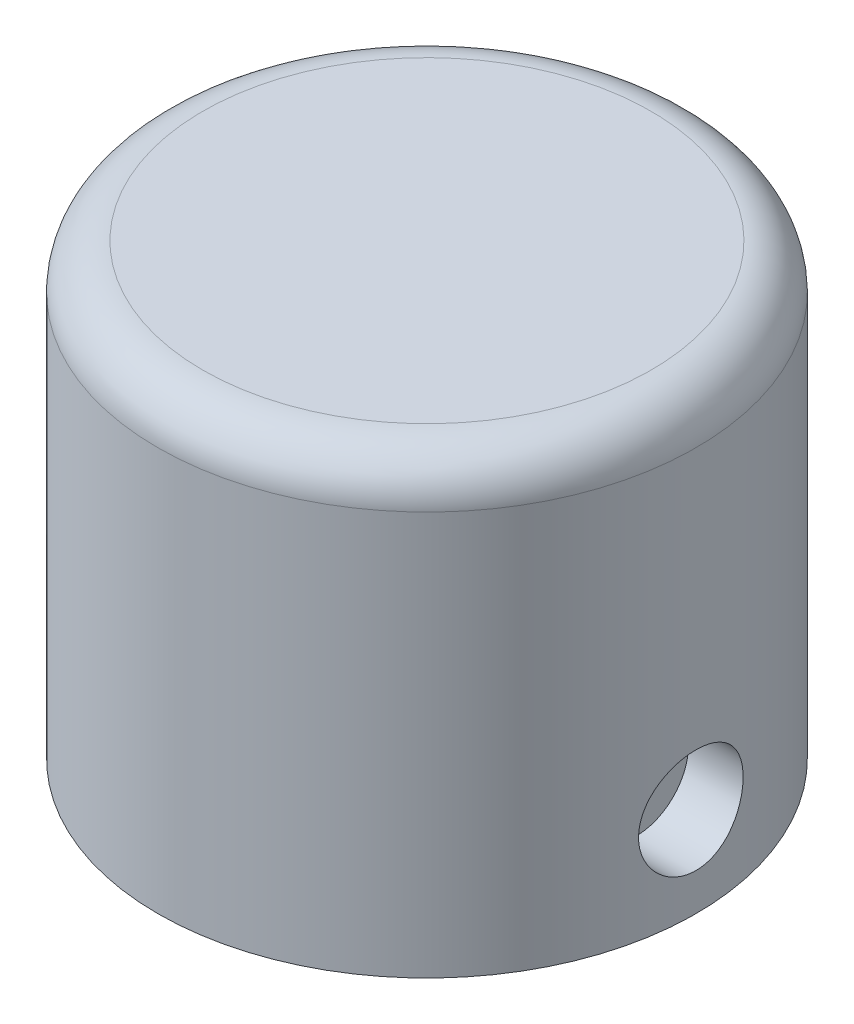
ISO-10303-21;
HEADER;
FILE_DESCRIPTION(('STEP AP214'),'2;1');
FILE_NAME('part.step','',(''),(''),'','','');
FILE_SCHEMA(('AUTOMOTIVE_DESIGN { 1 0 10303 214 1 1 1 1 }'));
ENDSEC;
DATA;
#1=APPLICATION_CONTEXT('core data for automotive mechanical design processes');
#2=APPLICATION_PROTOCOL_DEFINITION('international standard','automotive_design',2000,#1);
#3=PRODUCT_CONTEXT('',#1,'mechanical');
#4=PRODUCT('Part','Part','',(#3));
#5=PRODUCT_RELATED_PRODUCT_CATEGORY('part','',(#4));
#6=PRODUCT_DEFINITION_FORMATION('','',#4);
#7=PRODUCT_DEFINITION_CONTEXT('part definition',#1,'design');
#8=PRODUCT_DEFINITION('design','',#6,#7);
#9=PRODUCT_DEFINITION_SHAPE('','',#8);
#10=(LENGTH_UNIT() NAMED_UNIT(*) SI_UNIT(.MILLI.,.METRE.));
#11=(NAMED_UNIT(*) PLANE_ANGLE_UNIT() SI_UNIT($,.RADIAN.));
#12=(NAMED_UNIT(*) SI_UNIT($,.STERADIAN.) SOLID_ANGLE_UNIT());
#13=UNCERTAINTY_MEASURE_WITH_UNIT(LENGTH_MEASURE(1.E-05),#10,'distance_accuracy_value','');
#14=(GEOMETRIC_REPRESENTATION_CONTEXT(3) GLOBAL_UNCERTAINTY_ASSIGNED_CONTEXT((#13)) GLOBAL_UNIT_ASSIGNED_CONTEXT((#10,
#11,#12)) REPRESENTATION_CONTEXT('',''));
#15=CARTESIAN_POINT('',(0.,0.,0.));
#16=DIRECTION('',(0.,0.,1.));
#17=DIRECTION('',(1.,0.,0.));
#18=AXIS2_PLACEMENT_3D('',#15,#16,#17);
#19=CARTESIAN_POINT('',(0.,30.,0.));
#20=DIRECTION('',(0.,-1.,0.));
#21=DIRECTION('',(0.,0.,-1.));
#22=AXIS2_PLACEMENT_3D('',#19,#20,#21);
#23=CYLINDRICAL_SURFACE('',#22,18.);
#24=CARTESIAN_POINT('',(0.,9.25000000000001,0.));
#25=DIRECTION('',(0.,0.866025403784438,-0.500000000000001));
#26=DIRECTION('',(0.,-0.500000000000001,-0.866025403784438));
#27=AXIS2_PLACEMENT_3D('',#24,#25,#26);
#28=ELLIPSE('',#27,20.7846096908265,18.);
#29=CARTESIAN_POINT('',(-17.7785861361358,7.625,-2.81458256229943));
#30=VERTEX_POINT('',#29);
#31=CARTESIAN_POINT('',(-18.,9.25,0.));
#32=VERTEX_POINT('',#31);
#33=EDGE_CURVE('E44',#30,#32,#28,.T.);
#34=ORIENTED_EDGE('',*,*,#33,.T.);
#35=CARTESIAN_POINT('',(0.,9.25,0.));
#36=DIRECTION('',(0.,0.866025403784439,0.5));
#37=DIRECTION('',(0.,-0.5,0.866025403784439));
#38=AXIS2_PLACEMENT_3D('',#35,#36,#37);
#39=ELLIPSE('',#38,20.7846096908265,18.);
#40=CARTESIAN_POINT('',(-17.7785861361358,7.625,2.81458256229942));
#41=VERTEX_POINT('',#40);
#42=EDGE_CURVE('E11',#32,#41,#39,.T.);
#43=ORIENTED_EDGE('',*,*,#42,.T.);
#44=DIRECTION('',(0.,-1.,0.));
#45=VECTOR('',#44,1.);
#46=CARTESIAN_POINT('',(-17.7785861361358,30.,2.81458256229942));
#47=LINE('',#46,#45);
#48=CARTESIAN_POINT('',(-17.7785861361358,4.375,2.81458256229942));
#49=VERTEX_POINT('',#48);
#50=EDGE_CURVE('E116',#41,#49,#47,.T.);
#51=ORIENTED_EDGE('',*,*,#50,.T.);
#52=CARTESIAN_POINT('',(0.,2.75,0.));
#53=DIRECTION('',(0.,-0.866025403784439,0.5));
#54=DIRECTION('',(0.,-0.5,-0.866025403784439));
#55=AXIS2_PLACEMENT_3D('',#52,#53,#54);
#56=ELLIPSE('',#55,20.7846096908265,18.);
#57=CARTESIAN_POINT('',(-18.,2.75,0.));
#58=VERTEX_POINT('',#57);
#59=EDGE_CURVE('E283',#49,#58,#56,.T.);
#60=ORIENTED_EDGE('',*,*,#59,.T.);
#61=CARTESIAN_POINT('',(0.,2.75,0.));
#62=DIRECTION('',(0.,-0.866025403784439,-0.5));
#63=DIRECTION('',(0.,-0.5,0.866025403784439));
#64=AXIS2_PLACEMENT_3D('',#61,#62,#63);
#65=ELLIPSE('',#64,20.7846096908265,18.);
#66=CARTESIAN_POINT('',(-17.7785861361358,4.375,-2.81458256229943));
#67=VERTEX_POINT('',#66);
#68=EDGE_CURVE('E279',#58,#67,#65,.T.);
#69=ORIENTED_EDGE('',*,*,#68,.T.);
#70=DIRECTION('',(0.,-1.,0.));
#71=VECTOR('',#70,1.);
#72=CARTESIAN_POINT('',(-17.7785861361358,30.,-2.81458256229943));
#73=LINE('',#72,#71);
#74=EDGE_CURVE('E276',#67,#30,#73,.F.);
#75=ORIENTED_EDGE('',*,*,#74,.T.);
#76=EDGE_LOOP('',(#34,#43,#51,#60,#69,#75));
#77=FACE_BOUND('',#76,.T.);
#78=CARTESIAN_POINT('',(17.6564435830096,6.,3.5));
#79=CARTESIAN_POINT('',(17.6564474113677,6.19459215945551,3.4999926803676));
#80=CARTESIAN_POINT('',(17.6596954480625,6.38927774970128,3.48371657667026));
#81=CARTESIAN_POINT('',(17.6723188861831,6.7731494799643,3.41909176611392));
#82=CARTESIAN_POINT('',(17.6816993236076,6.96233096646206,3.37071669872324));
#83=CARTESIAN_POINT('',(17.7054859118633,7.32958501855153,3.24344395599034));
#84=CARTESIAN_POINT('',(17.7198872062412,7.50766812361753,3.16457576729264));
#85=CARTESIAN_POINT('',(17.752087082989,7.84806725988389,2.97863512235344));
#86=CARTESIAN_POINT('',(17.7698854417214,8.01038432794194,2.87156452257248));
#87=CARTESIAN_POINT('',(17.8071399255581,8.31682472440727,2.63073201128739));
#88=CARTESIAN_POINT('',(17.8266133706068,8.460706538923,2.49666542385836));
#89=CARTESIAN_POINT('',(17.8648711812362,8.7240855979194,2.20630496709418));
#90=CARTESIAN_POINT('',(17.8836554998458,8.84358118275155,2.05000958616622));
#91=CARTESIAN_POINT('',(17.9186048108641,9.05572764921247,1.71803470660234));
#92=CARTESIAN_POINT('',(17.9347470069833,9.14814983062574,1.54220645295941));
#93=CARTESIAN_POINT('',(17.9623990352521,9.30205124863418,1.17715119890279));
#94=CARTESIAN_POINT('',(17.9739092770843,9.36353322191872,0.987925385204834));
#95=CARTESIAN_POINT('',(17.990878155467,9.45305940180477,0.603951221166312));
#96=CARTESIAN_POINT('',(17.9964104863025,9.48151113097795,0.409301198280103));
#97=CARTESIAN_POINT('',(18.0010544857372,9.50543987867794,0.0179172352503131));
#98=CARTESIAN_POINT('',(18.0001667405244,9.50091990770074,-0.178816512999947));
#99=CARTESIAN_POINT('',(17.9921279362999,9.45934421137728,-0.565985585242537));
#100=CARTESIAN_POINT('',(17.9850613694551,9.42272737708908,-0.756470047778827));
#101=CARTESIAN_POINT('',(17.9655539723171,9.31869261029257,-1.12853832199391));
#102=CARTESIAN_POINT('',(17.9531129354825,9.25127349404358,-1.31012179130795));
#103=CARTESIAN_POINT('',(17.9241143347895,9.08713612395945,-1.66049513073351));
#104=CARTESIAN_POINT('',(17.9075324975832,8.99024434394386,-1.82920161897051));
#105=CARTESIAN_POINT('',(17.8720829011253,8.77004020310411,-2.14812435949058));
#106=CARTESIAN_POINT('',(17.8532148927049,8.64672496126962,-2.29833859270662));
#107=CARTESIAN_POINT('',(17.8149126889186,8.37476173518805,-2.5786155187675));
#108=CARTESIAN_POINT('',(17.7954742873123,8.22572970121311,-2.70830524976976));
#109=CARTESIAN_POINT('',(17.7585181514163,7.90783756080526,-2.94090900447571));
#110=CARTESIAN_POINT('',(17.7410004495969,7.73897711926311,-3.04382257555538));
#111=CARTESIAN_POINT('',(17.7098618130577,7.38570448089,-3.22007118303539));
#112=CARTESIAN_POINT('',(17.6962484789349,7.20126284334622,-3.29334863924129));
#113=CARTESIAN_POINT('',(17.6745735517619,6.82236040401726,-3.40776686158693));
#114=CARTESIAN_POINT('',(17.6665112781568,6.62790083356433,-3.44891156725498));
#115=CARTESIAN_POINT('',(17.6569868928188,6.23785508342176,-3.49734475459892));
#116=CARTESIAN_POINT('',(17.6554200388984,6.04233811313634,-3.50517057778965));
#117=CARTESIAN_POINT('',(17.658783135511,5.65279187383398,-3.48818729061262));
#118=CARTESIAN_POINT('',(17.6637127390468,5.45876252591497,-3.46337992329161));
#119=CARTESIAN_POINT('',(17.6794154560712,5.07948752680087,-3.3822968158626));
#120=CARTESIAN_POINT('',(17.6901356839333,4.89417863266072,-3.32630573421196));
#121=CARTESIAN_POINT('',(17.7161657427704,4.53557222037641,-3.18474789202439));
#122=CARTESIAN_POINT('',(17.7314759339918,4.36227564634218,-3.09917880995754));
#123=CARTESIAN_POINT('',(17.765197609816,4.03025463740114,-2.89966840663162));
#124=CARTESIAN_POINT('',(17.7836450951283,3.87173684159723,-2.78538940302993));
#125=CARTESIAN_POINT('',(17.8214628973458,3.57593242028392,-2.53215559932921));
#126=CARTESIAN_POINT('',(17.8408333036528,3.43864785709194,-2.39319840512706));
#127=CARTESIAN_POINT('',(17.8786528184893,3.18718307986549,-2.09214601985188));
#128=CARTESIAN_POINT('',(17.897084573851,3.07336531273408,-1.92974555323136));
#129=CARTESIAN_POINT('',(17.9306527332437,2.87463001673685,-1.58781602666329));
#130=CARTESIAN_POINT('',(17.9457892706235,2.78971131832427,-1.40828766025927));
#131=CARTESIAN_POINT('',(17.9709871788719,2.6517194495858,-1.03817322751808));
#132=CARTESIAN_POINT('',(17.9810762082708,2.59847241930565,-0.847653948590886));
#133=CARTESIAN_POINT('',(17.9951606828967,2.52478265001531,-0.460160702118323));
#134=CARTESIAN_POINT('',(17.999156819986,2.5043361864099,-0.263187470029565));
#135=CARTESIAN_POINT('',(18.0005900701503,2.49696562361796,0.12815412346204));
#136=CARTESIAN_POINT('',(17.998134023595,2.50949548259734,0.322512017985465));
#137=CARTESIAN_POINT('',(17.9871623183574,2.56652063405601,0.706296605220551));
#138=CARTESIAN_POINT('',(17.9786467274698,2.61101556890699,0.895723353077782));
#139=CARTESIAN_POINT('',(17.9565143859245,2.73047075585905,1.26395156874614));
#140=CARTESIAN_POINT('',(17.9429080610095,2.8053687693859,1.44277389299636));
#141=CARTESIAN_POINT('',(17.9120628354933,2.98343666166822,1.78539308345478));
#142=CARTESIAN_POINT('',(17.8948236673177,3.08660862308899,1.94918884161598));
#143=CARTESIAN_POINT('',(17.8582782195197,3.32015469821044,2.25981486185993));
#144=CARTESIAN_POINT('',(17.8389443253572,3.45092121649671,2.40634687689155));
#145=CARTESIAN_POINT('',(17.8005570717064,3.7351344745599,2.67557600640576));
#146=CARTESIAN_POINT('',(17.7815037795019,3.88858655965353,2.79826748761911));
#147=CARTESIAN_POINT('',(17.745624336369,4.21566778634815,3.01750157753964));
#148=CARTESIAN_POINT('',(17.7288225602539,4.38948465091195,3.11376825673525));
#149=CARTESIAN_POINT('',(17.6996441524627,4.75110040365367,3.27557805378553));
#150=CARTESIAN_POINT('',(17.6872634352054,4.93888618793214,3.34114955513121));
#151=CARTESIAN_POINT('',(17.6708502844218,5.27263040880722,3.42671536610982));
#152=CARTESIAN_POINT('',(17.6654806175749,5.41666195344792,3.45414887511059));
#153=CARTESIAN_POINT('',(17.6582758809388,5.70711140329528,3.49079366386978));
#154=CARTESIAN_POINT('',(17.6564407013799,5.85352923424919,3.50000550953423));
#155=CARTESIAN_POINT('',(17.6564435830096,6.,3.5));
#156=B_SPLINE_CURVE_WITH_KNOTS('',3,(#78,#79,#80,#81,#82,#83,#84,#85,#86,#87,#88,#89,#90,#91,
#92,#93,#94,#95,#96,#97,#98,#99,#100,#101,#102,#103,#104,#105,#106,#107,#108,#109,#110,#111,
#112,#113,#114,#115,#116,#117,#118,#119,#120,#121,#122,#123,#124,#125,#126,#127,#128,#129,#130,
#131,#132,#133,#134,#135,#136,#137,#138,#139,#140,#141,#142,#143,#144,#145,#146,#147,#148,#149,
#150,#151,#152,#153,#154,#155),.UNSPECIFIED.,.T.,.F.,(4,2,2,2,2,2,2,2,2,2,2,2,2,2,2,2,2,2,2,2,2,
2,2,2,2,2,2,2,2,2,2,2,2,2,2,2,2,2,4),(0.,0.583240311118946,1.16696018863393,1.75011701898952,
2.33323547187442,2.9233464716814,3.51349761916547,4.10849904355409,4.70344783027477,
5.29097547745552,5.87844948083058,6.45801354922419,7.03759989230727,7.62066697676662,
8.20379766673876,8.79653992343539,9.38929219919207,9.98319066752594,10.5770163114906,
11.1612280289567,11.7454085430076,12.3243417982081,12.9033205032753,13.4894570129324,
14.0756504164915,14.6703126625182,15.2649508396712,15.8562939128219,16.4475698325742,
17.0291168910496,17.6106574432226,18.1910134713514,18.7714122601305,19.3606999173644,
19.950126648247,20.5454923836491,21.1403064981384,21.5793288536977,22.018337574426),.UNSPECIFIED.);
#157=CARTESIAN_POINT('',(17.6564435830096,6.,3.5));
#158=VERTEX_POINT('',#157);
#159=EDGE_CURVE('E204',#158,#158,#156,.T.);
#160=ORIENTED_EDGE('',*,*,#159,.T.);
#161=EDGE_LOOP('',(#160));
#162=FACE_BOUND('',#161,.T.);
#163=CARTESIAN_POINT('',(0.,27.,0.));
#164=DIRECTION('',(0.,1.,0.));
#165=DIRECTION('',(0.,0.,1.));
#166=AXIS2_PLACEMENT_3D('',#163,#164,#165);
#167=CIRCLE('',#166,18.);
#168=CARTESIAN_POINT('',(0.,27.,18.));
#169=VERTEX_POINT('',#168);
#170=EDGE_CURVE('E199',#169,#169,#167,.F.);
#171=ORIENTED_EDGE('',*,*,#170,.T.);
#172=EDGE_LOOP('',(#171));
#173=FACE_BOUND('',#172,.T.);
#174=CARTESIAN_POINT('',(0.,0.,0.));
#175=DIRECTION('',(0.,1.,0.));
#176=DIRECTION('',(0.,0.,1.));
#177=AXIS2_PLACEMENT_3D('',#174,#175,#176);
#178=CIRCLE('',#177,18.);
#179=CARTESIAN_POINT('',(0.,0.,18.));
#180=VERTEX_POINT('',#179);
#181=EDGE_CURVE('E188',#180,#180,#178,.T.);
#182=ORIENTED_EDGE('',*,*,#181,.T.);
#183=EDGE_LOOP('',(#182));
#184=FACE_BOUND('',#183,.T.);
#185=ADVANCED_FACE('F36',(#77,#162,#173,#184),#23,.T.);
#186=CARTESIAN_POINT('',(0.,30.,0.));
#187=DIRECTION('',(0.,1.,0.));
#188=DIRECTION('',(0.,0.,1.));
#189=AXIS2_PLACEMENT_3D('',#186,#187,#188);
#190=PLANE('',#189);
#191=CARTESIAN_POINT('',(0.,30.,0.));
#192=DIRECTION('',(0.,1.,0.));
#193=DIRECTION('',(0.,0.,1.));
#194=AXIS2_PLACEMENT_3D('',#191,#192,#193);
#195=CIRCLE('',#194,15.);
#196=CARTESIAN_POINT('',(0.,30.,15.));
#197=VERTEX_POINT('',#196);
#198=EDGE_CURVE('E196',#197,#197,#195,.T.);
#199=ORIENTED_EDGE('',*,*,#198,.T.);
#200=EDGE_LOOP('',(#199));
#201=FACE_BOUND('',#200,.T.);
#202=ADVANCED_FACE('F248',(#201),#190,.T.);
#203=CARTESIAN_POINT('',(0.,0.,0.));
#204=DIRECTION('',(0.,1.,0.));
#205=DIRECTION('',(0.,0.,1.));
#206=AXIS2_PLACEMENT_3D('',#203,#204,#205);
#207=PLANE('',#206);
#208=DIRECTION('',(-1.,0.,0.));
#209=VECTOR('',#208,1.);
#210=CARTESIAN_POINT('',(-5.,0.,5.));
#211=LINE('',#210,#209);
#212=CARTESIAN_POINT('',(5.,0.,5.));
#213=VERTEX_POINT('',#212);
#214=CARTESIAN_POINT('',(-5.,0.,5.));
#215=VERTEX_POINT('',#214);
#216=EDGE_CURVE('E178',#213,#215,#211,.T.);
#217=ORIENTED_EDGE('',*,*,#216,.F.);
#218=DIRECTION('',(0.,0.,1.));
#219=VECTOR('',#218,1.);
#220=CARTESIAN_POINT('',(5.,0.,5.));
#221=LINE('',#220,#219);
#222=CARTESIAN_POINT('',(5.,0.,-5.));
#223=VERTEX_POINT('',#222);
#224=EDGE_CURVE('E59',#223,#213,#221,.T.);
#225=ORIENTED_EDGE('',*,*,#224,.F.);
#226=DIRECTION('',(1.,0.,0.));
#227=VECTOR('',#226,1.);
#228=CARTESIAN_POINT('',(-5.,0.,-5.));
#229=LINE('',#228,#227);
#230=CARTESIAN_POINT('',(-5.,0.,-5.));
#231=VERTEX_POINT('',#230);
#232=EDGE_CURVE('E167',#231,#223,#229,.T.);
#233=ORIENTED_EDGE('',*,*,#232,.F.);
#234=DIRECTION('',(0.,0.,-1.));
#235=VECTOR('',#234,1.);
#236=CARTESIAN_POINT('',(-5.,0.,5.));
#237=LINE('',#236,#235);
#238=EDGE_CURVE('E181',#215,#231,#237,.T.);
#239=ORIENTED_EDGE('',*,*,#238,.F.);
#240=EDGE_LOOP('',(#217,#225,#233,#239));
#241=FACE_BOUND('',#240,.T.);
#242=ORIENTED_EDGE('',*,*,#181,.F.);
#243=EDGE_LOOP('',(#242));
#244=FACE_BOUND('',#243,.T.);
#245=ADVANCED_FACE('F250',(#241,#244),#207,.F.);
#246=CARTESIAN_POINT('',(0.,27.,0.));
#247=DIRECTION('',(0.,1.,0.));
#248=DIRECTION('',(0.,0.,1.));
#249=AXIS2_PLACEMENT_3D('',#246,#247,#248);
#250=TOROIDAL_SURFACE('',#249,15.,3.);
#251=ORIENTED_EDGE('',*,*,#170,.F.);
#252=EDGE_LOOP('',(#251));
#253=FACE_BOUND('',#252,.T.);
#254=ORIENTED_EDGE('',*,*,#198,.F.);
#255=EDGE_LOOP('',(#254));
#256=FACE_BOUND('',#255,.T.);
#257=ADVANCED_FACE('F38',(#253,#256),#250,.T.);
#258=CARTESIAN_POINT('',(5.,25.,5.));
#259=DIRECTION('',(1.,0.,0.));
#260=DIRECTION('',(0.,0.,-1.));
#261=AXIS2_PLACEMENT_3D('',#258,#259,#260);
#262=PLANE('',#261);
#263=CARTESIAN_POINT('',(5.,6.,0.));
#264=DIRECTION('',(1.,0.,0.));
#265=DIRECTION('',(0.,0.,-1.));
#266=AXIS2_PLACEMENT_3D('',#263,#264,#265);
#267=CIRCLE('',#266,1.6);
#268=CARTESIAN_POINT('',(5.,6.,-1.6));
#269=VERTEX_POINT('',#268);
#270=EDGE_CURVE('E159',#269,#269,#267,.T.);
#271=ORIENTED_EDGE('',*,*,#270,.T.);
#272=EDGE_LOOP('',(#271));
#273=FACE_BOUND('',#272,.T.);
#274=ORIENTED_EDGE('',*,*,#224,.T.);
#275=DIRECTION('',(0.,-1.,0.));
#276=VECTOR('',#275,1.);
#277=CARTESIAN_POINT('',(5.,25.,5.));
#278=LINE('',#277,#276);
#279=CARTESIAN_POINT('',(5.,25.,5.));
#280=VERTEX_POINT('',#279);
#281=EDGE_CURVE('E176',#280,#213,#278,.T.);
#282=ORIENTED_EDGE('',*,*,#281,.F.);
#283=DIRECTION('',(0.,0.,1.));
#284=VECTOR('',#283,1.);
#285=CARTESIAN_POINT('',(5.,25.,5.));
#286=LINE('',#285,#284);
#287=CARTESIAN_POINT('',(5.,25.,-5.));
#288=VERTEX_POINT('',#287);
#289=EDGE_CURVE('E163',#288,#280,#286,.T.);
#290=ORIENTED_EDGE('',*,*,#289,.F.);
#291=DIRECTION('',(0.,-1.,0.));
#292=VECTOR('',#291,1.);
#293=CARTESIAN_POINT('',(5.,25.,-5.));
#294=LINE('',#293,#292);
#295=EDGE_CURVE('E186',#288,#223,#294,.T.);
#296=ORIENTED_EDGE('',*,*,#295,.T.);
#297=EDGE_LOOP('',(#274,#282,#290,#296));
#298=FACE_BOUND('',#297,.T.);
#299=ADVANCED_FACE('F237',(#273,#298),#262,.F.);
#300=CARTESIAN_POINT('',(-5.,25.,-5.));
#301=DIRECTION('',(0.,0.,-1.));
#302=DIRECTION('',(-1.,0.,0.));
#303=AXIS2_PLACEMENT_3D('',#300,#301,#302);
#304=PLANE('',#303);
#305=ORIENTED_EDGE('',*,*,#232,.T.);
#306=ORIENTED_EDGE('',*,*,#295,.F.);
#307=DIRECTION('',(1.,0.,0.));
#308=VECTOR('',#307,1.);
#309=CARTESIAN_POINT('',(-5.,25.,-5.));
#310=LINE('',#309,#308);
#311=CARTESIAN_POINT('',(-5.,25.,-5.));
#312=VERTEX_POINT('',#311);
#313=EDGE_CURVE('E173',#312,#288,#310,.T.);
#314=ORIENTED_EDGE('',*,*,#313,.F.);
#315=DIRECTION('',(0.,-1.,0.));
#316=VECTOR('',#315,1.);
#317=CARTESIAN_POINT('',(-5.,25.,-5.));
#318=LINE('',#317,#316);
#319=EDGE_CURVE('E189',#312,#231,#318,.T.);
#320=ORIENTED_EDGE('',*,*,#319,.T.);
#321=EDGE_LOOP('',(#305,#306,#314,#320));
#322=FACE_BOUND('',#321,.T.);
#323=ADVANCED_FACE('F233',(#322),#304,.F.);
#324=CARTESIAN_POINT('',(-5.,25.,5.));
#325=DIRECTION('',(-1.,0.,0.));
#326=DIRECTION('',(0.,0.,1.));
#327=AXIS2_PLACEMENT_3D('',#324,#325,#326);
#328=PLANE('',#327);
#329=CARTESIAN_POINT('',(-5.,6.,0.));
#330=DIRECTION('',(-1.,0.,0.));
#331=DIRECTION('',(0.,0.,1.));
#332=AXIS2_PLACEMENT_3D('',#329,#330,#331);
#333=CIRCLE('',#332,1.6);
#334=CARTESIAN_POINT('',(-5.,6.,1.6));
#335=VERTEX_POINT('',#334);
#336=EDGE_CURVE('E162',#335,#335,#333,.T.);
#337=ORIENTED_EDGE('',*,*,#336,.T.);
#338=EDGE_LOOP('',(#337));
#339=FACE_BOUND('',#338,.T.);
#340=ORIENTED_EDGE('',*,*,#238,.T.);
#341=ORIENTED_EDGE('',*,*,#319,.F.);
#342=DIRECTION('',(0.,0.,-1.));
#343=VECTOR('',#342,1.);
#344=CARTESIAN_POINT('',(-5.,25.,5.));
#345=LINE('',#344,#343);
#346=CARTESIAN_POINT('',(-5.,25.,5.));
#347=VERTEX_POINT('',#346);
#348=EDGE_CURVE('E170',#347,#312,#345,.T.);
#349=ORIENTED_EDGE('',*,*,#348,.F.);
#350=DIRECTION('',(0.,-1.,0.));
#351=VECTOR('',#350,1.);
#352=CARTESIAN_POINT('',(-5.,25.,5.));
#353=LINE('',#352,#351);
#354=EDGE_CURVE('E191',#347,#215,#353,.T.);
#355=ORIENTED_EDGE('',*,*,#354,.T.);
#356=EDGE_LOOP('',(#340,#341,#349,#355));
#357=FACE_BOUND('',#356,.T.);
#358=ADVANCED_FACE('F236',(#339,#357),#328,.F.);
#359=CARTESIAN_POINT('',(-5.,25.,5.));
#360=DIRECTION('',(0.,0.,1.));
#361=DIRECTION('',(1.,0.,0.));
#362=AXIS2_PLACEMENT_3D('',#359,#360,#361);
#363=PLANE('',#362);
#364=ORIENTED_EDGE('',*,*,#216,.T.);
#365=ORIENTED_EDGE('',*,*,#354,.F.);
#366=DIRECTION('',(-1.,0.,0.));
#367=VECTOR('',#366,1.);
#368=CARTESIAN_POINT('',(-5.,25.,5.));
#369=LINE('',#368,#367);
#370=EDGE_CURVE('E166',#280,#347,#369,.T.);
#371=ORIENTED_EDGE('',*,*,#370,.F.);
#372=ORIENTED_EDGE('',*,*,#281,.T.);
#373=EDGE_LOOP('',(#364,#365,#371,#372));
#374=FACE_BOUND('',#373,.T.);
#375=ADVANCED_FACE('F231',(#374),#363,.F.);
#376=CARTESIAN_POINT('',(0.,25.,0.));
#377=DIRECTION('',(0.,-1.,0.));
#378=DIRECTION('',(0.,0.,-1.));
#379=AXIS2_PLACEMENT_3D('',#376,#377,#378);
#380=PLANE('',#379);
#381=ORIENTED_EDGE('',*,*,#289,.T.);
#382=ORIENTED_EDGE('',*,*,#370,.T.);
#383=ORIENTED_EDGE('',*,*,#348,.T.);
#384=ORIENTED_EDGE('',*,*,#313,.T.);
#385=EDGE_LOOP('',(#381,#382,#383,#384));
#386=FACE_BOUND('',#385,.T.);
#387=ADVANCED_FACE('F228',(#386),#380,.T.);
#388=CARTESIAN_POINT('',(18.,6.,0.));
#389=DIRECTION('',(-1.,0.,0.));
#390=DIRECTION('',(0.,0.,1.));
#391=AXIS2_PLACEMENT_3D('',#388,#389,#390);
#392=CYLINDRICAL_SURFACE('',#391,1.6);
#393=CARTESIAN_POINT('',(-13.,6.,0.));
#394=DIRECTION('',(1.,0.,0.));
#395=DIRECTION('',(0.,0.,-1.));
#396=AXIS2_PLACEMENT_3D('',#393,#394,#395);
#397=CIRCLE('',#396,1.6);
#398=CARTESIAN_POINT('',(-13.,6.,-1.6));
#399=VERTEX_POINT('',#398);
#400=EDGE_CURVE('E147',#399,#399,#397,.F.);
#401=ORIENTED_EDGE('',*,*,#400,.T.);
#402=EDGE_LOOP('',(#401));
#403=FACE_BOUND('',#402,.T.);
#404=ORIENTED_EDGE('',*,*,#336,.F.);
#405=EDGE_LOOP('',(#404));
#406=FACE_BOUND('',#405,.T.);
#407=ADVANCED_FACE('F226',(#403,#406),#392,.F.);
#408=CARTESIAN_POINT('',(14.,6.,0.));
#409=DIRECTION('',(-1.,0.,0.));
#410=DIRECTION('',(0.,0.,1.));
#411=AXIS2_PLACEMENT_3D('',#408,#409,#410);
#412=CIRCLE('',#411,1.6);
#413=CARTESIAN_POINT('',(14.,6.,1.6));
#414=VERTEX_POINT('',#413);
#415=EDGE_CURVE('E158',#414,#414,#412,.F.);
#416=ORIENTED_EDGE('',*,*,#415,.T.);
#417=EDGE_LOOP('',(#416));
#418=FACE_BOUND('',#417,.T.);
#419=ORIENTED_EDGE('',*,*,#270,.F.);
#420=EDGE_LOOP('',(#419));
#421=FACE_BOUND('',#420,.T.);
#422=ADVANCED_FACE('F221',(#418,#421),#392,.F.);
#423=CARTESIAN_POINT('',(34.,6.,0.));
#424=DIRECTION('',(-1.,0.,0.));
#425=DIRECTION('',(0.,0.,1.));
#426=AXIS2_PLACEMENT_3D('',#423,#424,#425);
#427=CYLINDRICAL_SURFACE('',#426,3.5);
#428=CARTESIAN_POINT('',(14.,6.,0.));
#429=DIRECTION('',(-1.,0.,0.));
#430=DIRECTION('',(0.,0.,1.));
#431=AXIS2_PLACEMENT_3D('',#428,#429,#430);
#432=CIRCLE('',#431,3.5);
#433=CARTESIAN_POINT('',(14.,6.,3.5));
#434=VERTEX_POINT('',#433);
#435=EDGE_CURVE('E155',#434,#434,#432,.T.);
#436=ORIENTED_EDGE('',*,*,#435,.T.);
#437=EDGE_LOOP('',(#436));
#438=FACE_BOUND('',#437,.T.);
#439=ORIENTED_EDGE('',*,*,#159,.F.);
#440=EDGE_LOOP('',(#439));
#441=FACE_BOUND('',#440,.T.);
#442=ADVANCED_FACE('F215',(#438,#441),#427,.F.);
#443=CARTESIAN_POINT('',(14.,6.,0.));
#444=DIRECTION('',(-1.,0.,0.));
#445=DIRECTION('',(0.,0.,1.));
#446=AXIS2_PLACEMENT_3D('',#443,#444,#445);
#447=PLANE('',#446);
#448=ORIENTED_EDGE('',*,*,#435,.F.);
#449=EDGE_LOOP('',(#448));
#450=FACE_BOUND('',#449,.T.);
#451=ORIENTED_EDGE('',*,*,#415,.F.);
#452=EDGE_LOOP('',(#451));
#453=FACE_BOUND('',#452,.T.);
#454=ADVANCED_FACE('F220',(#450,#453),#447,.F.);
#455=CARTESIAN_POINT('',(-29.,9.25,0.));
#456=DIRECTION('',(0.,0.866025403784439,0.5));
#457=DIRECTION('',(0.,-0.5,0.866025403784439));
#458=AXIS2_PLACEMENT_3D('',#455,#456,#457);
#459=PLANE('',#458);
#460=DIRECTION('',(1.,0.,0.));
#461=VECTOR('',#460,1.);
#462=CARTESIAN_POINT('',(-29.,9.25,0.));
#463=LINE('',#462,#461);
#464=CARTESIAN_POINT('',(-13.,9.25,0.));
#465=VERTEX_POINT('',#464);
#466=EDGE_CURVE('E135',#32,#465,#463,.T.);
#467=ORIENTED_EDGE('',*,*,#466,.T.);
#468=DIRECTION('',(0.,-0.5,0.866025403784439));
#469=VECTOR('',#468,1.);
#470=CARTESIAN_POINT('',(-13.,9.25,0.));
#471=LINE('',#470,#469);
#472=CARTESIAN_POINT('',(-13.,7.625,2.81458256229942));
#473=VERTEX_POINT('',#472);
#474=EDGE_CURVE('E127',#465,#473,#471,.T.);
#475=ORIENTED_EDGE('',*,*,#474,.T.);
#476=DIRECTION('',(1.,0.,0.));
#477=VECTOR('',#476,1.);
#478=CARTESIAN_POINT('',(-29.,7.625,2.81458256229942));
#479=LINE('',#478,#477);
#480=EDGE_CURVE('E111',#41,#473,#479,.T.);
#481=ORIENTED_EDGE('',*,*,#480,.F.);
#482=ORIENTED_EDGE('',*,*,#42,.F.);
#483=EDGE_LOOP('',(#467,#475,#481,#482));
#484=FACE_BOUND('',#483,.T.);
#485=ADVANCED_FACE('F133',(#484),#459,.F.);
#486=CARTESIAN_POINT('',(-29.,7.625,-2.81458256229943));
#487=DIRECTION('',(0.,0.866025403784438,-0.500000000000001));
#488=DIRECTION('',(0.,0.500000000000001,0.866025403784438));
#489=AXIS2_PLACEMENT_3D('',#486,#487,#488);
#490=PLANE('',#489);
#491=DIRECTION('',(1.,0.,0.));
#492=VECTOR('',#491,1.);
#493=CARTESIAN_POINT('',(-29.,7.625,-2.81458256229943));
#494=LINE('',#493,#492);
#495=CARTESIAN_POINT('',(-13.,7.625,-2.81458256229943));
#496=VERTEX_POINT('',#495);
#497=EDGE_CURVE('E148',#30,#496,#494,.T.);
#498=ORIENTED_EDGE('',*,*,#497,.T.);
#499=DIRECTION('',(0.,0.500000000000001,0.866025403784438));
#500=VECTOR('',#499,1.);
#501=CARTESIAN_POINT('',(-13.,7.625,-2.81458256229943));
#502=LINE('',#501,#500);
#503=EDGE_CURVE('E119',#496,#465,#502,.T.);
#504=ORIENTED_EDGE('',*,*,#503,.T.);
#505=ORIENTED_EDGE('',*,*,#466,.F.);
#506=ORIENTED_EDGE('',*,*,#33,.F.);
#507=EDGE_LOOP('',(#498,#504,#505,#506));
#508=FACE_BOUND('',#507,.T.);
#509=ADVANCED_FACE('F294',(#508),#490,.F.);
#510=CARTESIAN_POINT('',(-29.,4.375,-2.81458256229943));
#511=DIRECTION('',(0.,0.,-1.));
#512=DIRECTION('',(0.,1.,0.));
#513=AXIS2_PLACEMENT_3D('',#510,#511,#512);
#514=PLANE('',#513);
#515=DIRECTION('',(1.,0.,0.));
#516=VECTOR('',#515,1.);
#517=CARTESIAN_POINT('',(-29.,4.375,-2.81458256229943));
#518=LINE('',#517,#516);
#519=CARTESIAN_POINT('',(-13.,4.375,-2.81458256229943));
#520=VERTEX_POINT('',#519);
#521=EDGE_CURVE('E150',#67,#520,#518,.T.);
#522=ORIENTED_EDGE('',*,*,#521,.T.);
#523=DIRECTION('',(0.,1.,0.));
#524=VECTOR('',#523,1.);
#525=CARTESIAN_POINT('',(-13.,4.375,-2.81458256229943));
#526=LINE('',#525,#524);
#527=EDGE_CURVE('E142',#520,#496,#526,.T.);
#528=ORIENTED_EDGE('',*,*,#527,.T.);
#529=ORIENTED_EDGE('',*,*,#497,.F.);
#530=ORIENTED_EDGE('',*,*,#74,.F.);
#531=EDGE_LOOP('',(#522,#528,#529,#530));
#532=FACE_BOUND('',#531,.T.);
#533=ADVANCED_FACE('F293',(#532),#514,.F.);
#534=CARTESIAN_POINT('',(-29.,2.75,0.));
#535=DIRECTION('',(0.,-0.866025403784439,-0.5));
#536=DIRECTION('',(0.,0.5,-0.866025403784439));
#537=AXIS2_PLACEMENT_3D('',#534,#535,#536);
#538=PLANE('',#537);
#539=DIRECTION('',(1.,0.,0.));
#540=VECTOR('',#539,1.);
#541=CARTESIAN_POINT('',(-29.,2.75,0.));
#542=LINE('',#541,#540);
#543=CARTESIAN_POINT('',(-13.,2.75,0.));
#544=VERTEX_POINT('',#543);
#545=EDGE_CURVE('E152',#58,#544,#542,.T.);
#546=ORIENTED_EDGE('',*,*,#545,.T.);
#547=DIRECTION('',(0.,0.5,-0.866025403784439));
#548=VECTOR('',#547,1.);
#549=CARTESIAN_POINT('',(-13.,2.75,0.));
#550=LINE('',#549,#548);
#551=EDGE_CURVE('E139',#544,#520,#550,.T.);
#552=ORIENTED_EDGE('',*,*,#551,.T.);
#553=ORIENTED_EDGE('',*,*,#521,.F.);
#554=ORIENTED_EDGE('',*,*,#68,.F.);
#555=EDGE_LOOP('',(#546,#552,#553,#554));
#556=FACE_BOUND('',#555,.T.);
#557=ADVANCED_FACE('F289',(#556),#538,.F.);
#558=CARTESIAN_POINT('',(-29.,4.375,2.81458256229942));
#559=DIRECTION('',(0.,-0.866025403784439,0.5));
#560=DIRECTION('',(0.,-0.5,-0.866025403784439));
#561=AXIS2_PLACEMENT_3D('',#558,#559,#560);
#562=PLANE('',#561);
#563=DIRECTION('',(1.,0.,0.));
#564=VECTOR('',#563,1.);
#565=CARTESIAN_POINT('',(-29.,4.375,2.81458256229942));
#566=LINE('',#565,#564);
#567=CARTESIAN_POINT('',(-13.,4.375,2.81458256229942));
#568=VERTEX_POINT('',#567);
#569=EDGE_CURVE('E51',#49,#568,#566,.T.);
#570=ORIENTED_EDGE('',*,*,#569,.T.);
#571=DIRECTION('',(0.,-0.5,-0.866025403784439));
#572=VECTOR('',#571,1.);
#573=CARTESIAN_POINT('',(-13.,4.375,2.81458256229942));
#574=LINE('',#573,#572);
#575=EDGE_CURVE('E131',#568,#544,#574,.T.);
#576=ORIENTED_EDGE('',*,*,#575,.T.);
#577=ORIENTED_EDGE('',*,*,#545,.F.);
#578=ORIENTED_EDGE('',*,*,#59,.F.);
#579=EDGE_LOOP('',(#570,#576,#577,#578));
#580=FACE_BOUND('',#579,.T.);
#581=ADVANCED_FACE('F287',(#580),#562,.F.);
#582=CARTESIAN_POINT('',(-29.,7.625,2.81458256229942));
#583=DIRECTION('',(0.,0.,1.));
#584=DIRECTION('',(1.,0.,0.));
#585=AXIS2_PLACEMENT_3D('',#582,#583,#584);
#586=PLANE('',#585);
#587=ORIENTED_EDGE('',*,*,#480,.T.);
#588=DIRECTION('',(0.,-1.,0.));
#589=VECTOR('',#588,1.);
#590=CARTESIAN_POINT('',(-13.,7.625,2.81458256229942));
#591=LINE('',#590,#589);
#592=EDGE_CURVE('E114',#473,#568,#591,.T.);
#593=ORIENTED_EDGE('',*,*,#592,.T.);
#594=ORIENTED_EDGE('',*,*,#569,.F.);
#595=ORIENTED_EDGE('',*,*,#50,.F.);
#596=EDGE_LOOP('',(#587,#593,#594,#595));
#597=FACE_BOUND('',#596,.T.);
#598=ADVANCED_FACE('F113',(#597),#586,.F.);
#599=CARTESIAN_POINT('',(-13.,0.,0.));
#600=DIRECTION('',(1.,0.,0.));
#601=DIRECTION('',(0.,0.,-1.));
#602=AXIS2_PLACEMENT_3D('',#599,#600,#601);
#603=PLANE('',#602);
#604=ORIENTED_EDGE('',*,*,#474,.F.);
#605=ORIENTED_EDGE('',*,*,#503,.F.);
#606=ORIENTED_EDGE('',*,*,#527,.F.);
#607=ORIENTED_EDGE('',*,*,#551,.F.);
#608=ORIENTED_EDGE('',*,*,#575,.F.);
#609=ORIENTED_EDGE('',*,*,#592,.F.);
#610=EDGE_LOOP('',(#604,#605,#606,#607,#608,#609));
#611=FACE_BOUND('',#610,.T.);
#612=ORIENTED_EDGE('',*,*,#400,.F.);
#613=EDGE_LOOP('',(#612));
#614=FACE_BOUND('',#613,.T.);
#615=ADVANCED_FACE('F124',(#611,#614),#603,.F.);
#616=CLOSED_SHELL('',(#185,#202,#245,#257,#299,#323,#358,#375,#387,#407,#422,#442,#454,#485,
#509,#533,#557,#581,#598,#615));
#617=MANIFOLD_SOLID_BREP('B2',#616);
#618=ADVANCED_BREP_SHAPE_REPRESENTATION('',(#18,#617),#14);
#619=SHAPE_DEFINITION_REPRESENTATION(#9,#618);
ENDSEC;
END-ISO-10303-21;
